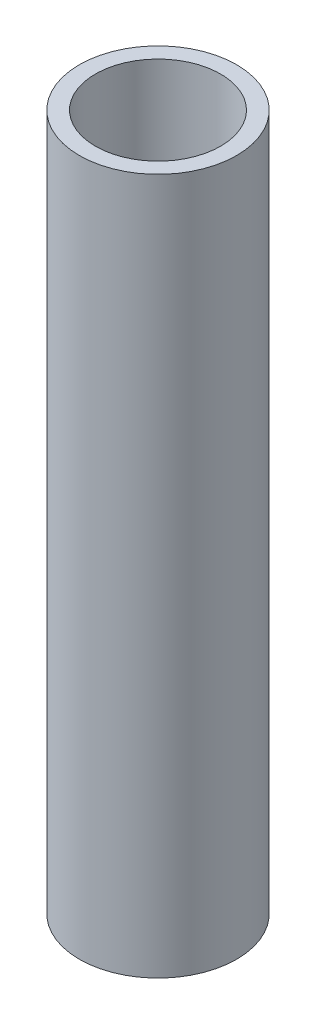
ISO-10303-21;
HEADER;
FILE_DESCRIPTION(('STEP AP214'),'2;1');
FILE_NAME('part.step','',(''),(''),'','','');
FILE_SCHEMA(('AUTOMOTIVE_DESIGN { 1 0 10303 214 1 1 1 1 }'));
ENDSEC;
DATA;
#1=APPLICATION_CONTEXT('core data for automotive mechanical design processes');
#2=APPLICATION_PROTOCOL_DEFINITION('international standard','automotive_design',2000,#1);
#3=PRODUCT_CONTEXT('',#1,'mechanical');
#4=PRODUCT('Part','Part','',(#3));
#5=PRODUCT_RELATED_PRODUCT_CATEGORY('part','',(#4));
#6=PRODUCT_DEFINITION_FORMATION('','',#4);
#7=PRODUCT_DEFINITION_CONTEXT('part definition',#1,'design');
#8=PRODUCT_DEFINITION('design','',#6,#7);
#9=PRODUCT_DEFINITION_SHAPE('','',#8);
#10=(LENGTH_UNIT() NAMED_UNIT(*) SI_UNIT(.MILLI.,.METRE.));
#11=(NAMED_UNIT(*) PLANE_ANGLE_UNIT() SI_UNIT($,.RADIAN.));
#12=(NAMED_UNIT(*) SI_UNIT($,.STERADIAN.) SOLID_ANGLE_UNIT());
#13=UNCERTAINTY_MEASURE_WITH_UNIT(LENGTH_MEASURE(1.E-05),#10,'distance_accuracy_value','');
#14=(GEOMETRIC_REPRESENTATION_CONTEXT(3) GLOBAL_UNCERTAINTY_ASSIGNED_CONTEXT((#13)) GLOBAL_UNIT_ASSIGNED_CONTEXT((#10,
#11,#12)) REPRESENTATION_CONTEXT('',''));
#15=CARTESIAN_POINT('',(0.,0.,0.));
#16=DIRECTION('',(0.,0.,1.));
#17=DIRECTION('',(1.,0.,0.));
#18=AXIS2_PLACEMENT_3D('',#15,#16,#17);
#19=CARTESIAN_POINT('',(0.,-104.521,0.));
#20=DIRECTION('',(0.,1.,0.));
#21=DIRECTION('',(0.,0.,1.));
#22=AXIS2_PLACEMENT_3D('',#19,#20,#21);
#23=CYLINDRICAL_SURFACE('',#22,11.811);
#24=CARTESIAN_POINT('',(0.,-104.521,0.));
#25=DIRECTION('',(0.,1.,0.));
#26=DIRECTION('',(0.,0.,1.));
#27=AXIS2_PLACEMENT_3D('',#24,#25,#26);
#28=CIRCLE('',#27,11.811);
#29=CARTESIAN_POINT('',(0.,-104.521,11.811));
#30=VERTEX_POINT('',#29);
#31=EDGE_CURVE('E11',#30,#30,#28,.T.);
#32=ORIENTED_EDGE('',*,*,#31,.T.);
#33=EDGE_LOOP('',(#32));
#34=FACE_BOUND('',#33,.T.);
#35=CARTESIAN_POINT('',(0.,0.,0.));
#36=DIRECTION('',(0.,1.,0.));
#37=DIRECTION('',(0.,0.,1.));
#38=AXIS2_PLACEMENT_3D('',#35,#36,#37);
#39=CIRCLE('',#38,11.811);
#40=CARTESIAN_POINT('',(0.,0.,11.811));
#41=VERTEX_POINT('',#40);
#42=EDGE_CURVE('E40',#41,#41,#39,.T.);
#43=ORIENTED_EDGE('',*,*,#42,.F.);
#44=EDGE_LOOP('',(#43));
#45=FACE_BOUND('',#44,.T.);
#46=ADVANCED_FACE('F33',(#34,#45),#23,.T.);
#47=CARTESIAN_POINT('',(0.,-104.521,0.));
#48=DIRECTION('',(0.,1.,0.));
#49=DIRECTION('',(0.,0.,1.));
#50=AXIS2_PLACEMENT_3D('',#47,#48,#49);
#51=PLANE('',#50);
#52=CARTESIAN_POINT('',(0.,-104.521,0.));
#53=DIRECTION('',(0.,1.,0.));
#54=DIRECTION('',(0.,0.,1.));
#55=AXIS2_PLACEMENT_3D('',#52,#53,#54);
#56=CIRCLE('',#55,6.096);
#57=CARTESIAN_POINT('',(0.,-104.521,6.096));
#58=VERTEX_POINT('',#57);
#59=EDGE_CURVE('E52',#58,#58,#56,.T.);
#60=ORIENTED_EDGE('',*,*,#59,.T.);
#61=EDGE_LOOP('',(#60));
#62=FACE_BOUND('',#61,.T.);
#63=ORIENTED_EDGE('',*,*,#31,.F.);
#64=EDGE_LOOP('',(#63));
#65=FACE_BOUND('',#64,.T.);
#66=ADVANCED_FACE('F77',(#62,#65),#51,.F.);
#67=CARTESIAN_POINT('',(0.,0.,0.));
#68=DIRECTION('',(0.,1.,0.));
#69=DIRECTION('',(0.,0.,1.));
#70=AXIS2_PLACEMENT_3D('',#67,#68,#69);
#71=PLANE('',#70);
#72=CARTESIAN_POINT('',(0.,0.,0.));
#73=DIRECTION('',(0.,1.,0.));
#74=DIRECTION('',(0.,0.,1.));
#75=AXIS2_PLACEMENT_3D('',#72,#73,#74);
#76=CIRCLE('',#75,9.398);
#77=CARTESIAN_POINT('',(0.,0.,9.398));
#78=VERTEX_POINT('',#77);
#79=EDGE_CURVE('E49',#78,#78,#76,.T.);
#80=ORIENTED_EDGE('',*,*,#79,.F.);
#81=EDGE_LOOP('',(#80));
#82=FACE_BOUND('',#81,.T.);
#83=ORIENTED_EDGE('',*,*,#42,.T.);
#84=EDGE_LOOP('',(#83));
#85=FACE_BOUND('',#84,.T.);
#86=ADVANCED_FACE('F71',(#82,#85),#71,.T.);
#87=CARTESIAN_POINT('',(0.,-131.102558118365,0.));
#88=DIRECTION('',(0.,1.,0.));
#89=DIRECTION('',(0.,0.,1.));
#90=AXIS2_PLACEMENT_3D('',#87,#88,#89);
#91=CYLINDRICAL_SURFACE('',#90,9.398);
#92=CARTESIAN_POINT('',(0.,-99.441,0.));
#93=DIRECTION('',(0.,1.,0.));
#94=DIRECTION('',(0.,0.,1.));
#95=AXIS2_PLACEMENT_3D('',#92,#93,#94);
#96=CIRCLE('',#95,9.398);
#97=CARTESIAN_POINT('',(0.,-99.441,9.398));
#98=VERTEX_POINT('',#97);
#99=EDGE_CURVE('E45',#98,#98,#96,.F.);
#100=ORIENTED_EDGE('',*,*,#99,.T.);
#101=EDGE_LOOP('',(#100));
#102=FACE_BOUND('',#101,.T.);
#103=ORIENTED_EDGE('',*,*,#79,.T.);
#104=EDGE_LOOP('',(#103));
#105=FACE_BOUND('',#104,.T.);
#106=ADVANCED_FACE('F65',(#102,#105),#91,.F.);
#107=CARTESIAN_POINT('',(0.,-99.441,0.));
#108=DIRECTION('',(0.,1.,0.));
#109=DIRECTION('',(0.,0.,1.));
#110=AXIS2_PLACEMENT_3D('',#107,#108,#109);
#111=PLANE('',#110);
#112=CARTESIAN_POINT('',(0.,-99.441,0.));
#113=DIRECTION('',(0.,1.,0.));
#114=DIRECTION('',(0.,0.,1.));
#115=AXIS2_PLACEMENT_3D('',#112,#113,#114);
#116=CIRCLE('',#115,6.096);
#117=CARTESIAN_POINT('',(0.,-99.441,6.096));
#118=VERTEX_POINT('',#117);
#119=EDGE_CURVE('E36',#118,#118,#116,.T.);
#120=ORIENTED_EDGE('',*,*,#119,.F.);
#121=EDGE_LOOP('',(#120));
#122=FACE_BOUND('',#121,.T.);
#123=ORIENTED_EDGE('',*,*,#99,.F.);
#124=EDGE_LOOP('',(#123));
#125=FACE_BOUND('',#124,.T.);
#126=ADVANCED_FACE('F62',(#122,#125),#111,.T.);
#127=CARTESIAN_POINT('',(0.,-104.521,0.));
#128=DIRECTION('',(0.,1.,0.));
#129=DIRECTION('',(0.,0.,1.));
#130=AXIS2_PLACEMENT_3D('',#127,#128,#129);
#131=CYLINDRICAL_SURFACE('',#130,6.096);
#132=ORIENTED_EDGE('',*,*,#119,.T.);
#133=EDGE_LOOP('',(#132));
#134=FACE_BOUND('',#133,.T.);
#135=ORIENTED_EDGE('',*,*,#59,.F.);
#136=EDGE_LOOP('',(#135));
#137=FACE_BOUND('',#136,.T.);
#138=ADVANCED_FACE('F59',(#134,#137),#131,.F.);
#139=CLOSED_SHELL('',(#46,#66,#86,#106,#126,#138));
#140=MANIFOLD_SOLID_BREP('B2',#139);
#141=ADVANCED_BREP_SHAPE_REPRESENTATION('',(#18,#140),#14);
#142=SHAPE_DEFINITION_REPRESENTATION(#9,#141);
ENDSEC;
END-ISO-10303-21;
